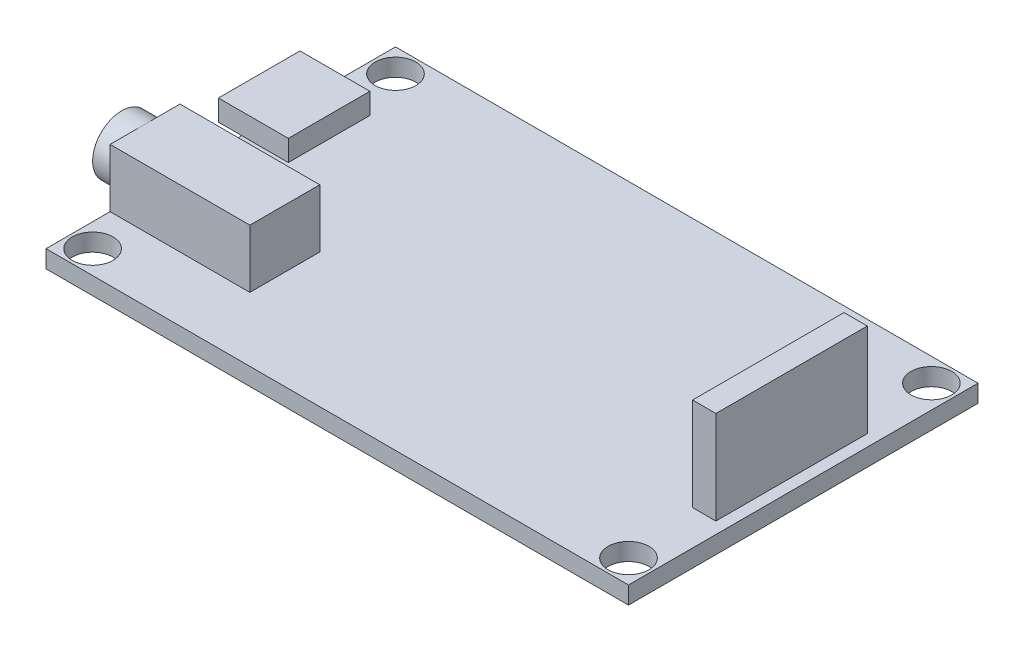
ISO-10303-21;
HEADER;
FILE_DESCRIPTION(('STEP AP214'),'2;1');
FILE_NAME('part.step','',(''),(''),'','','');
FILE_SCHEMA(('AUTOMOTIVE_DESIGN { 1 0 10303 214 1 1 1 1 }'));
ENDSEC;
DATA;
#1=APPLICATION_CONTEXT('core data for automotive mechanical design processes');
#2=APPLICATION_PROTOCOL_DEFINITION('international standard','automotive_design',2000,#1);
#3=PRODUCT_CONTEXT('',#1,'mechanical');
#4=PRODUCT('Part','Part','',(#3));
#5=PRODUCT_RELATED_PRODUCT_CATEGORY('part','',(#4));
#6=PRODUCT_DEFINITION_FORMATION('','',#4);
#7=PRODUCT_DEFINITION_CONTEXT('part definition',#1,'design');
#8=PRODUCT_DEFINITION('design','',#6,#7);
#9=PRODUCT_DEFINITION_SHAPE('','',#8);
#10=(LENGTH_UNIT() NAMED_UNIT(*) SI_UNIT(.MILLI.,.METRE.));
#11=(NAMED_UNIT(*) PLANE_ANGLE_UNIT() SI_UNIT($,.RADIAN.));
#12=(NAMED_UNIT(*) SI_UNIT($,.STERADIAN.) SOLID_ANGLE_UNIT());
#13=UNCERTAINTY_MEASURE_WITH_UNIT(LENGTH_MEASURE(1.E-05),#10,'distance_accuracy_value','');
#14=(GEOMETRIC_REPRESENTATION_CONTEXT(3) GLOBAL_UNCERTAINTY_ASSIGNED_CONTEXT((#13)) GLOBAL_UNIT_ASSIGNED_CONTEXT((#10,
#11,#12)) REPRESENTATION_CONTEXT('',''));
#15=CARTESIAN_POINT('',(0.,0.,0.));
#16=DIRECTION('',(0.,0.,1.));
#17=DIRECTION('',(1.,0.,0.));
#18=AXIS2_PLACEMENT_3D('',#15,#16,#17);
#19=CARTESIAN_POINT('',(0.,1.5,0.));
#20=DIRECTION('',(0.,1.,0.));
#21=DIRECTION('',(0.,0.,1.));
#22=AXIS2_PLACEMENT_3D('',#19,#20,#21);
#23=PLANE('',#22);
#24=CARTESIAN_POINT('',(48.,1.5,2.));
#25=DIRECTION('',(0.,1.,0.));
#26=DIRECTION('',(0.,0.,1.));
#27=AXIS2_PLACEMENT_3D('',#24,#25,#26);
#28=CIRCLE('',#27,1.75);
#29=CARTESIAN_POINT('',(48.,1.5,3.75));
#30=VERTEX_POINT('',#29);
#31=EDGE_CURVE('E269',#30,#30,#28,.T.);
#32=ORIENTED_EDGE('',*,*,#31,.F.);
#33=EDGE_LOOP('',(#32));
#34=FACE_BOUND('',#33,.T.);
#35=CARTESIAN_POINT('',(2.,1.5,2.));
#36=DIRECTION('',(0.,1.,0.));
#37=DIRECTION('',(0.,0.,1.));
#38=AXIS2_PLACEMENT_3D('',#35,#36,#37);
#39=CIRCLE('',#38,1.75);
#40=CARTESIAN_POINT('',(2.,1.5,3.75));
#41=VERTEX_POINT('',#40);
#42=EDGE_CURVE('E275',#41,#41,#39,.T.);
#43=ORIENTED_EDGE('',*,*,#42,.F.);
#44=EDGE_LOOP('',(#43));
#45=FACE_BOUND('',#44,.T.);
#46=CARTESIAN_POINT('',(2.,1.5,28.));
#47=DIRECTION('',(0.,1.,0.));
#48=DIRECTION('',(0.,0.,1.));
#49=AXIS2_PLACEMENT_3D('',#46,#47,#48);
#50=CIRCLE('',#49,1.75);
#51=CARTESIAN_POINT('',(2.,1.5,29.75));
#52=VERTEX_POINT('',#51);
#53=EDGE_CURVE('E264',#52,#52,#50,.T.);
#54=ORIENTED_EDGE('',*,*,#53,.F.);
#55=EDGE_LOOP('',(#54));
#56=FACE_BOUND('',#55,.T.);
#57=CARTESIAN_POINT('',(48.,1.5,28.));
#58=DIRECTION('',(0.,1.,0.));
#59=DIRECTION('',(0.,0.,1.));
#60=AXIS2_PLACEMENT_3D('',#57,#58,#59);
#61=CIRCLE('',#60,1.75);
#62=CARTESIAN_POINT('',(48.,1.5,29.75));
#63=VERTEX_POINT('',#62);
#64=EDGE_CURVE('E268',#63,#63,#61,.T.);
#65=ORIENTED_EDGE('',*,*,#64,.F.);
#66=EDGE_LOOP('',(#65));
#67=FACE_BOUND('',#66,.T.);
#68=DIRECTION('',(1.,0.,0.));
#69=VECTOR('',#68,1.);
#70=CARTESIAN_POINT('',(47.,1.5,21.5));
#71=LINE('',#70,#69);
#72=CARTESIAN_POINT('',(47.,1.5,21.5));
#73=VERTEX_POINT('',#72);
#74=CARTESIAN_POINT('',(49.,1.5,21.5));
#75=VERTEX_POINT('',#74);
#76=EDGE_CURVE('E249',#73,#75,#71,.T.);
#77=ORIENTED_EDGE('',*,*,#76,.F.);
#78=DIRECTION('',(0.,0.,1.));
#79=VECTOR('',#78,1.);
#80=CARTESIAN_POINT('',(47.,1.5,8.5));
#81=LINE('',#80,#79);
#82=CARTESIAN_POINT('',(47.,1.5,8.5));
#83=VERTEX_POINT('',#82);
#84=EDGE_CURVE('E235',#83,#73,#81,.T.);
#85=ORIENTED_EDGE('',*,*,#84,.F.);
#86=DIRECTION('',(-1.,0.,0.));
#87=VECTOR('',#86,1.);
#88=CARTESIAN_POINT('',(47.,1.5,8.5));
#89=LINE('',#88,#87);
#90=CARTESIAN_POINT('',(49.,1.5,8.5));
#91=VERTEX_POINT('',#90);
#92=EDGE_CURVE('E240',#91,#83,#89,.T.);
#93=ORIENTED_EDGE('',*,*,#92,.F.);
#94=DIRECTION('',(0.,0.,-1.));
#95=VECTOR('',#94,1.);
#96=CARTESIAN_POINT('',(49.,1.5,8.5));
#97=LINE('',#96,#95);
#98=EDGE_CURVE('E251',#75,#91,#97,.T.);
#99=ORIENTED_EDGE('',*,*,#98,.F.);
#100=EDGE_LOOP('',(#77,#85,#93,#99));
#101=FACE_BOUND('',#100,.T.);
#102=DIRECTION('',(0.,0.,-1.));
#103=VECTOR('',#102,1.);
#104=CARTESIAN_POINT('',(4.,1.5,13.2));
#105=LINE('',#104,#103);
#106=CARTESIAN_POINT('',(4.,1.5,13.2));
#107=VERTEX_POINT('',#106);
#108=CARTESIAN_POINT('',(4.,1.5,6.2));
#109=VERTEX_POINT('',#108);
#110=EDGE_CURVE('E62',#107,#109,#105,.T.);
#111=ORIENTED_EDGE('',*,*,#110,.F.);
#112=DIRECTION('',(1.,0.,0.));
#113=VECTOR('',#112,1.);
#114=CARTESIAN_POINT('',(-2.,1.5,13.2));
#115=LINE('',#114,#113);
#116=CARTESIAN_POINT('',(0.,1.5,13.2));
#117=VERTEX_POINT('',#116);
#118=EDGE_CURVE('E351',#117,#107,#115,.T.);
#119=ORIENTED_EDGE('',*,*,#118,.F.);
#120=DIRECTION('',(0.,0.,1.));
#121=VECTOR('',#120,1.);
#122=CARTESIAN_POINT('',(0.,1.5,0.));
#123=LINE('',#122,#121);
#124=CARTESIAN_POINT('',(0.,1.5,18.5));
#125=VERTEX_POINT('',#124);
#126=EDGE_CURVE('E293',#117,#125,#123,.T.);
#127=ORIENTED_EDGE('',*,*,#126,.T.);
#128=DIRECTION('',(-1.,0.,0.));
#129=VECTOR('',#128,1.);
#130=CARTESIAN_POINT('',(0.,1.5,18.5));
#131=LINE('',#130,#129);
#132=CARTESIAN_POINT('',(12.,1.5,18.5));
#133=VERTEX_POINT('',#132);
#134=EDGE_CURVE('E221',#133,#125,#131,.T.);
#135=ORIENTED_EDGE('',*,*,#134,.F.);
#136=DIRECTION('',(0.,0.,-1.));
#137=VECTOR('',#136,1.);
#138=CARTESIAN_POINT('',(12.,1.5,24.5));
#139=LINE('',#138,#137);
#140=CARTESIAN_POINT('',(12.,1.5,24.5));
#141=VERTEX_POINT('',#140);
#142=EDGE_CURVE('E218',#141,#133,#139,.T.);
#143=ORIENTED_EDGE('',*,*,#142,.F.);
#144=DIRECTION('',(1.,0.,0.));
#145=VECTOR('',#144,1.);
#146=CARTESIAN_POINT('',(0.,1.5,24.5));
#147=LINE('',#146,#145);
#148=CARTESIAN_POINT('',(0.,1.5,24.5));
#149=VERTEX_POINT('',#148);
#150=EDGE_CURVE('E204',#149,#141,#147,.T.);
#151=ORIENTED_EDGE('',*,*,#150,.F.);
#152=CARTESIAN_POINT('',(0.,1.5,30.));
#153=VERTEX_POINT('',#152);
#154=EDGE_CURVE('E294',#149,#153,#123,.T.);
#155=ORIENTED_EDGE('',*,*,#154,.T.);
#156=DIRECTION('',(1.,0.,0.));
#157=VECTOR('',#156,1.);
#158=CARTESIAN_POINT('',(0.,1.5,30.));
#159=LINE('',#158,#157);
#160=CARTESIAN_POINT('',(50.,1.5,30.));
#161=VERTEX_POINT('',#160);
#162=EDGE_CURVE('E291',#153,#161,#159,.T.);
#163=ORIENTED_EDGE('',*,*,#162,.T.);
#164=DIRECTION('',(0.,0.,-1.));
#165=VECTOR('',#164,1.);
#166=CARTESIAN_POINT('',(50.,1.5,0.));
#167=LINE('',#166,#165);
#168=CARTESIAN_POINT('',(50.,1.5,0.));
#169=VERTEX_POINT('',#168);
#170=EDGE_CURVE('E296',#161,#169,#167,.T.);
#171=ORIENTED_EDGE('',*,*,#170,.T.);
#172=DIRECTION('',(-1.,0.,0.));
#173=VECTOR('',#172,1.);
#174=CARTESIAN_POINT('',(0.,1.5,0.));
#175=LINE('',#174,#173);
#176=CARTESIAN_POINT('',(0.,1.5,0.));
#177=VERTEX_POINT('',#176);
#178=EDGE_CURVE('E298',#169,#177,#175,.T.);
#179=ORIENTED_EDGE('',*,*,#178,.T.);
#180=CARTESIAN_POINT('',(0.,1.5,6.2));
#181=VERTEX_POINT('',#180);
#182=EDGE_CURVE('E289',#177,#181,#123,.T.);
#183=ORIENTED_EDGE('',*,*,#182,.T.);
#184=DIRECTION('',(-1.,0.,0.));
#185=VECTOR('',#184,1.);
#186=CARTESIAN_POINT('',(-2.,1.5,6.2));
#187=LINE('',#186,#185);
#188=EDGE_CURVE('E67',#109,#181,#187,.T.);
#189=ORIENTED_EDGE('',*,*,#188,.F.);
#190=EDGE_LOOP('',(#111,#119,#127,#135,#143,#151,#155,#163,#171,#179,#183,#189));
#191=FACE_BOUND('',#190,.T.);
#192=ADVANCED_FACE('F47',(#34,#45,#56,#67,#101,#191),#23,.T.);
#193=CARTESIAN_POINT('',(0.,1.5,0.));
#194=DIRECTION('',(1.,0.,0.));
#195=DIRECTION('',(0.,0.,-1.));
#196=AXIS2_PLACEMENT_3D('',#193,#194,#195);
#197=PLANE('',#196);
#198=DIRECTION('',(0.,0.,1.));
#199=VECTOR('',#198,1.);
#200=CARTESIAN_POINT('',(0.,6.5,24.5));
#201=LINE('',#200,#199);
#202=CARTESIAN_POINT('',(0.,6.5,21.5));
#203=VERTEX_POINT('',#202);
#204=CARTESIAN_POINT('',(0.,6.5,24.5));
#205=VERTEX_POINT('',#204);
#206=EDGE_CURVE('E209',#203,#205,#201,.T.);
#207=ORIENTED_EDGE('',*,*,#206,.F.);
#208=CARTESIAN_POINT('',(0.,4.,21.5));
#209=DIRECTION('',(-1.,0.,0.));
#210=DIRECTION('',(0.,0.,1.));
#211=AXIS2_PLACEMENT_3D('',#208,#209,#210);
#212=CIRCLE('',#211,2.5);
#213=EDGE_CURVE('E194',#203,#203,#212,.T.);
#214=ORIENTED_EDGE('',*,*,#213,.F.);
#215=CARTESIAN_POINT('',(0.,6.5,18.5));
#216=VERTEX_POINT('',#215);
#217=EDGE_CURVE('E206',#216,#203,#201,.T.);
#218=ORIENTED_EDGE('',*,*,#217,.F.);
#219=DIRECTION('',(0.,-1.,0.));
#220=VECTOR('',#219,1.);
#221=CARTESIAN_POINT('',(0.,6.5,18.5));
#222=LINE('',#221,#220);
#223=EDGE_CURVE('E215',#216,#125,#222,.T.);
#224=ORIENTED_EDGE('',*,*,#223,.T.);
#225=ORIENTED_EDGE('',*,*,#126,.F.);
#226=EDGE_CURVE('E292',#181,#117,#123,.T.);
#227=ORIENTED_EDGE('',*,*,#226,.F.);
#228=ORIENTED_EDGE('',*,*,#182,.F.);
#229=DIRECTION('',(0.,-1.,0.));
#230=VECTOR('',#229,1.);
#231=CARTESIAN_POINT('',(0.,1.5,0.));
#232=LINE('',#231,#230);
#233=CARTESIAN_POINT('',(0.,0.,0.));
#234=VERTEX_POINT('',#233);
#235=EDGE_CURVE('E300',#177,#234,#232,.T.);
#236=ORIENTED_EDGE('',*,*,#235,.T.);
#237=DIRECTION('',(0.,0.,1.));
#238=VECTOR('',#237,1.);
#239=CARTESIAN_POINT('',(0.,0.,0.));
#240=LINE('',#239,#238);
#241=CARTESIAN_POINT('',(0.,0.,30.));
#242=VERTEX_POINT('',#241);
#243=EDGE_CURVE('E286',#234,#242,#240,.T.);
#244=ORIENTED_EDGE('',*,*,#243,.T.);
#245=DIRECTION('',(0.,-1.,0.));
#246=VECTOR('',#245,1.);
#247=CARTESIAN_POINT('',(0.,1.5,30.));
#248=LINE('',#247,#246);
#249=EDGE_CURVE('E13',#153,#242,#248,.T.);
#250=ORIENTED_EDGE('',*,*,#249,.F.);
#251=ORIENTED_EDGE('',*,*,#154,.F.);
#252=DIRECTION('',(0.,-1.,0.));
#253=VECTOR('',#252,1.);
#254=CARTESIAN_POINT('',(0.,6.5,24.5));
#255=LINE('',#254,#253);
#256=EDGE_CURVE('E232',#205,#149,#255,.T.);
#257=ORIENTED_EDGE('',*,*,#256,.F.);
#258=EDGE_LOOP('',(#207,#214,#218,#224,#225,#227,#228,#236,#244,#250,#251,#257));
#259=FACE_BOUND('',#258,.T.);
#260=ADVANCED_FACE('F49',(#259),#197,.F.);
#261=CARTESIAN_POINT('',(0.,1.5,30.));
#262=DIRECTION('',(0.,0.,-1.));
#263=DIRECTION('',(-1.,0.,0.));
#264=AXIS2_PLACEMENT_3D('',#261,#262,#263);
#265=PLANE('',#264);
#266=DIRECTION('',(1.,0.,0.));
#267=VECTOR('',#266,1.);
#268=CARTESIAN_POINT('',(0.,0.,30.));
#269=LINE('',#268,#267);
#270=CARTESIAN_POINT('',(50.,0.,30.));
#271=VERTEX_POINT('',#270);
#272=EDGE_CURVE('E303',#242,#271,#269,.T.);
#273=ORIENTED_EDGE('',*,*,#272,.T.);
#274=DIRECTION('',(0.,-1.,0.));
#275=VECTOR('',#274,1.);
#276=CARTESIAN_POINT('',(50.,1.5,30.));
#277=LINE('',#276,#275);
#278=EDGE_CURVE('E55',#161,#271,#277,.T.);
#279=ORIENTED_EDGE('',*,*,#278,.F.);
#280=ORIENTED_EDGE('',*,*,#162,.F.);
#281=ORIENTED_EDGE('',*,*,#249,.T.);
#282=EDGE_LOOP('',(#273,#279,#280,#281));
#283=FACE_BOUND('',#282,.T.);
#284=ADVANCED_FACE('F369',(#283),#265,.F.);
#285=CARTESIAN_POINT('',(50.,1.5,0.));
#286=DIRECTION('',(-1.,0.,0.));
#287=DIRECTION('',(0.,0.,1.));
#288=AXIS2_PLACEMENT_3D('',#285,#286,#287);
#289=PLANE('',#288);
#290=DIRECTION('',(0.,0.,-1.));
#291=VECTOR('',#290,1.);
#292=CARTESIAN_POINT('',(50.,0.,0.));
#293=LINE('',#292,#291);
#294=CARTESIAN_POINT('',(50.,0.,0.));
#295=VERTEX_POINT('',#294);
#296=EDGE_CURVE('E305',#271,#295,#293,.T.);
#297=ORIENTED_EDGE('',*,*,#296,.T.);
#298=DIRECTION('',(0.,-1.,0.));
#299=VECTOR('',#298,1.);
#300=CARTESIAN_POINT('',(50.,1.5,0.));
#301=LINE('',#300,#299);
#302=EDGE_CURVE('E311',#169,#295,#301,.T.);
#303=ORIENTED_EDGE('',*,*,#302,.F.);
#304=ORIENTED_EDGE('',*,*,#170,.F.);
#305=ORIENTED_EDGE('',*,*,#278,.T.);
#306=EDGE_LOOP('',(#297,#303,#304,#305));
#307=FACE_BOUND('',#306,.T.);
#308=ADVANCED_FACE('F318',(#307),#289,.F.);
#309=CARTESIAN_POINT('',(0.,1.5,0.));
#310=DIRECTION('',(0.,0.,1.));
#311=DIRECTION('',(1.,0.,0.));
#312=AXIS2_PLACEMENT_3D('',#309,#310,#311);
#313=PLANE('',#312);
#314=DIRECTION('',(-1.,0.,0.));
#315=VECTOR('',#314,1.);
#316=CARTESIAN_POINT('',(0.,0.,0.));
#317=LINE('',#316,#315);
#318=EDGE_CURVE('E307',#295,#234,#317,.T.);
#319=ORIENTED_EDGE('',*,*,#318,.T.);
#320=ORIENTED_EDGE('',*,*,#235,.F.);
#321=ORIENTED_EDGE('',*,*,#178,.F.);
#322=ORIENTED_EDGE('',*,*,#302,.T.);
#323=EDGE_LOOP('',(#319,#320,#321,#322));
#324=FACE_BOUND('',#323,.T.);
#325=ADVANCED_FACE('F328',(#324),#313,.F.);
#326=CARTESIAN_POINT('',(0.,0.,0.));
#327=DIRECTION('',(0.,1.,0.));
#328=DIRECTION('',(0.,0.,1.));
#329=AXIS2_PLACEMENT_3D('',#326,#327,#328);
#330=PLANE('',#329);
#331=CARTESIAN_POINT('',(48.,0.,2.));
#332=DIRECTION('',(0.,1.,0.));
#333=DIRECTION('',(0.,0.,1.));
#334=AXIS2_PLACEMENT_3D('',#331,#332,#333);
#335=CIRCLE('',#334,1.75);
#336=CARTESIAN_POINT('',(48.,0.,3.75));
#337=VERTEX_POINT('',#336);
#338=EDGE_CURVE('E265',#337,#337,#335,.T.);
#339=ORIENTED_EDGE('',*,*,#338,.T.);
#340=EDGE_LOOP('',(#339));
#341=FACE_BOUND('',#340,.T.);
#342=CARTESIAN_POINT('',(2.,0.,2.));
#343=DIRECTION('',(0.,1.,0.));
#344=DIRECTION('',(0.,0.,1.));
#345=AXIS2_PLACEMENT_3D('',#342,#343,#344);
#346=CIRCLE('',#345,1.75);
#347=CARTESIAN_POINT('',(2.,0.,3.75));
#348=VERTEX_POINT('',#347);
#349=EDGE_CURVE('E272',#348,#348,#346,.T.);
#350=ORIENTED_EDGE('',*,*,#349,.T.);
#351=EDGE_LOOP('',(#350));
#352=FACE_BOUND('',#351,.T.);
#353=CARTESIAN_POINT('',(2.,0.,28.));
#354=DIRECTION('',(0.,1.,0.));
#355=DIRECTION('',(0.,0.,1.));
#356=AXIS2_PLACEMENT_3D('',#353,#354,#355);
#357=CIRCLE('',#356,1.75);
#358=CARTESIAN_POINT('',(2.,0.,29.75));
#359=VERTEX_POINT('',#358);
#360=EDGE_CURVE('E278',#359,#359,#357,.T.);
#361=ORIENTED_EDGE('',*,*,#360,.T.);
#362=EDGE_LOOP('',(#361));
#363=FACE_BOUND('',#362,.T.);
#364=CARTESIAN_POINT('',(48.,0.,28.));
#365=DIRECTION('',(0.,1.,0.));
#366=DIRECTION('',(0.,0.,1.));
#367=AXIS2_PLACEMENT_3D('',#364,#365,#366);
#368=CIRCLE('',#367,1.75);
#369=CARTESIAN_POINT('',(48.,0.,29.75));
#370=VERTEX_POINT('',#369);
#371=EDGE_CURVE('E283',#370,#370,#368,.T.);
#372=ORIENTED_EDGE('',*,*,#371,.T.);
#373=EDGE_LOOP('',(#372));
#374=FACE_BOUND('',#373,.T.);
#375=ORIENTED_EDGE('',*,*,#243,.F.);
#376=ORIENTED_EDGE('',*,*,#318,.F.);
#377=ORIENTED_EDGE('',*,*,#296,.F.);
#378=ORIENTED_EDGE('',*,*,#272,.F.);
#379=EDGE_LOOP('',(#375,#376,#377,#378));
#380=FACE_BOUND('',#379,.T.);
#381=ADVANCED_FACE('F325',(#341,#352,#363,#374,#380),#330,.F.);
#382=CARTESIAN_POINT('',(48.,0.,28.));
#383=DIRECTION('',(0.,1.,0.));
#384=DIRECTION('',(0.,0.,1.));
#385=AXIS2_PLACEMENT_3D('',#382,#383,#384);
#386=CYLINDRICAL_SURFACE('',#385,1.75);
#387=ORIENTED_EDGE('',*,*,#371,.F.);
#388=EDGE_LOOP('',(#387));
#389=FACE_BOUND('',#388,.T.);
#390=ORIENTED_EDGE('',*,*,#64,.T.);
#391=EDGE_LOOP('',(#390));
#392=FACE_BOUND('',#391,.T.);
#393=ADVANCED_FACE('F374',(#389,#392),#386,.F.);
#394=CARTESIAN_POINT('',(2.,0.,28.));
#395=DIRECTION('',(0.,1.,0.));
#396=DIRECTION('',(0.,0.,1.));
#397=AXIS2_PLACEMENT_3D('',#394,#395,#396);
#398=CYLINDRICAL_SURFACE('',#397,1.75);
#399=ORIENTED_EDGE('',*,*,#360,.F.);
#400=EDGE_LOOP('',(#399));
#401=FACE_BOUND('',#400,.T.);
#402=ORIENTED_EDGE('',*,*,#53,.T.);
#403=EDGE_LOOP('',(#402));
#404=FACE_BOUND('',#403,.T.);
#405=ADVANCED_FACE('F449',(#401,#404),#398,.F.);
#406=CARTESIAN_POINT('',(2.,0.,2.));
#407=DIRECTION('',(0.,1.,0.));
#408=DIRECTION('',(0.,0.,1.));
#409=AXIS2_PLACEMENT_3D('',#406,#407,#408);
#410=CYLINDRICAL_SURFACE('',#409,1.75);
#411=ORIENTED_EDGE('',*,*,#349,.F.);
#412=EDGE_LOOP('',(#411));
#413=FACE_BOUND('',#412,.T.);
#414=ORIENTED_EDGE('',*,*,#42,.T.);
#415=EDGE_LOOP('',(#414));
#416=FACE_BOUND('',#415,.T.);
#417=ADVANCED_FACE('F446',(#413,#416),#410,.F.);
#418=CARTESIAN_POINT('',(48.,0.,2.));
#419=DIRECTION('',(0.,1.,0.));
#420=DIRECTION('',(0.,0.,1.));
#421=AXIS2_PLACEMENT_3D('',#418,#419,#420);
#422=CYLINDRICAL_SURFACE('',#421,1.75);
#423=ORIENTED_EDGE('',*,*,#338,.F.);
#424=EDGE_LOOP('',(#423));
#425=FACE_BOUND('',#424,.T.);
#426=ORIENTED_EDGE('',*,*,#31,.T.);
#427=EDGE_LOOP('',(#426));
#428=FACE_BOUND('',#427,.T.);
#429=ADVANCED_FACE('F442',(#425,#428),#422,.F.);
#430=CARTESIAN_POINT('',(47.,9.5,8.5));
#431=DIRECTION('',(1.,0.,0.));
#432=DIRECTION('',(0.,0.,-1.));
#433=AXIS2_PLACEMENT_3D('',#430,#431,#432);
#434=PLANE('',#433);
#435=ORIENTED_EDGE('',*,*,#84,.T.);
#436=DIRECTION('',(0.,-1.,0.));
#437=VECTOR('',#436,1.);
#438=CARTESIAN_POINT('',(47.,9.5,21.5));
#439=LINE('',#438,#437);
#440=CARTESIAN_POINT('',(47.,9.5,21.5));
#441=VERTEX_POINT('',#440);
#442=EDGE_CURVE('E262',#441,#73,#439,.T.);
#443=ORIENTED_EDGE('',*,*,#442,.F.);
#444=DIRECTION('',(0.,0.,1.));
#445=VECTOR('',#444,1.);
#446=CARTESIAN_POINT('',(47.,9.5,8.5));
#447=LINE('',#446,#445);
#448=CARTESIAN_POINT('',(47.,9.5,8.5));
#449=VERTEX_POINT('',#448);
#450=EDGE_CURVE('E236',#449,#441,#447,.T.);
#451=ORIENTED_EDGE('',*,*,#450,.F.);
#452=DIRECTION('',(0.,-1.,0.));
#453=VECTOR('',#452,1.);
#454=CARTESIAN_POINT('',(47.,9.5,8.5));
#455=LINE('',#454,#453);
#456=EDGE_CURVE('E246',#449,#83,#455,.T.);
#457=ORIENTED_EDGE('',*,*,#456,.T.);
#458=EDGE_LOOP('',(#435,#443,#451,#457));
#459=FACE_BOUND('',#458,.T.);
#460=ADVANCED_FACE('F438',(#459),#434,.F.);
#461=CARTESIAN_POINT('',(47.,9.5,21.5));
#462=DIRECTION('',(0.,0.,-1.));
#463=DIRECTION('',(-1.,0.,0.));
#464=AXIS2_PLACEMENT_3D('',#461,#462,#463);
#465=PLANE('',#464);
#466=ORIENTED_EDGE('',*,*,#76,.T.);
#467=DIRECTION('',(0.,-1.,0.));
#468=VECTOR('',#467,1.);
#469=CARTESIAN_POINT('',(49.,9.5,21.5));
#470=LINE('',#469,#468);
#471=CARTESIAN_POINT('',(49.,9.5,21.5));
#472=VERTEX_POINT('',#471);
#473=EDGE_CURVE('E259',#472,#75,#470,.T.);
#474=ORIENTED_EDGE('',*,*,#473,.F.);
#475=DIRECTION('',(1.,0.,0.));
#476=VECTOR('',#475,1.);
#477=CARTESIAN_POINT('',(47.,9.5,21.5));
#478=LINE('',#477,#476);
#479=EDGE_CURVE('E239',#441,#472,#478,.T.);
#480=ORIENTED_EDGE('',*,*,#479,.F.);
#481=ORIENTED_EDGE('',*,*,#442,.T.);
#482=EDGE_LOOP('',(#466,#474,#480,#481));
#483=FACE_BOUND('',#482,.T.);
#484=ADVANCED_FACE('F434',(#483),#465,.F.);
#485=CARTESIAN_POINT('',(49.,9.5,8.5));
#486=DIRECTION('',(-1.,0.,0.));
#487=DIRECTION('',(0.,0.,1.));
#488=AXIS2_PLACEMENT_3D('',#485,#486,#487);
#489=PLANE('',#488);
#490=ORIENTED_EDGE('',*,*,#98,.T.);
#491=DIRECTION('',(0.,-1.,0.));
#492=VECTOR('',#491,1.);
#493=CARTESIAN_POINT('',(49.,9.5,8.5));
#494=LINE('',#493,#492);
#495=CARTESIAN_POINT('',(49.,9.5,8.5));
#496=VERTEX_POINT('',#495);
#497=EDGE_CURVE('E257',#496,#91,#494,.T.);
#498=ORIENTED_EDGE('',*,*,#497,.F.);
#499=DIRECTION('',(0.,0.,-1.));
#500=VECTOR('',#499,1.);
#501=CARTESIAN_POINT('',(49.,9.5,8.5));
#502=LINE('',#501,#500);
#503=EDGE_CURVE('E242',#472,#496,#502,.T.);
#504=ORIENTED_EDGE('',*,*,#503,.F.);
#505=ORIENTED_EDGE('',*,*,#473,.T.);
#506=EDGE_LOOP('',(#490,#498,#504,#505));
#507=FACE_BOUND('',#506,.T.);
#508=ADVANCED_FACE('F430',(#507),#489,.F.);
#509=CARTESIAN_POINT('',(47.,9.5,8.5));
#510=DIRECTION('',(0.,0.,1.));
#511=DIRECTION('',(1.,0.,0.));
#512=AXIS2_PLACEMENT_3D('',#509,#510,#511);
#513=PLANE('',#512);
#514=ORIENTED_EDGE('',*,*,#92,.T.);
#515=ORIENTED_EDGE('',*,*,#456,.F.);
#516=DIRECTION('',(-1.,0.,0.));
#517=VECTOR('',#516,1.);
#518=CARTESIAN_POINT('',(47.,9.5,8.5));
#519=LINE('',#518,#517);
#520=EDGE_CURVE('E244',#496,#449,#519,.T.);
#521=ORIENTED_EDGE('',*,*,#520,.F.);
#522=ORIENTED_EDGE('',*,*,#497,.T.);
#523=EDGE_LOOP('',(#514,#515,#521,#522));
#524=FACE_BOUND('',#523,.T.);
#525=ADVANCED_FACE('F426',(#524),#513,.F.);
#526=CARTESIAN_POINT('',(0.,9.5,0.));
#527=DIRECTION('',(0.,1.,0.));
#528=DIRECTION('',(0.,0.,1.));
#529=AXIS2_PLACEMENT_3D('',#526,#527,#528);
#530=PLANE('',#529);
#531=ORIENTED_EDGE('',*,*,#450,.T.);
#532=ORIENTED_EDGE('',*,*,#479,.T.);
#533=ORIENTED_EDGE('',*,*,#503,.T.);
#534=ORIENTED_EDGE('',*,*,#520,.T.);
#535=EDGE_LOOP('',(#531,#532,#533,#534));
#536=FACE_BOUND('',#535,.T.);
#537=ADVANCED_FACE('F423',(#536),#530,.T.);
#538=CARTESIAN_POINT('',(0.,6.5,24.5));
#539=DIRECTION('',(0.,0.,-1.));
#540=DIRECTION('',(-1.,0.,0.));
#541=AXIS2_PLACEMENT_3D('',#538,#539,#540);
#542=PLANE('',#541);
#543=ORIENTED_EDGE('',*,*,#150,.T.);
#544=DIRECTION('',(0.,-1.,0.));
#545=VECTOR('',#544,1.);
#546=CARTESIAN_POINT('',(12.,6.5,24.5));
#547=LINE('',#546,#545);
#548=CARTESIAN_POINT('',(12.,6.5,24.5));
#549=VERTEX_POINT('',#548);
#550=EDGE_CURVE('E229',#549,#141,#547,.T.);
#551=ORIENTED_EDGE('',*,*,#550,.F.);
#552=DIRECTION('',(1.,0.,0.));
#553=VECTOR('',#552,1.);
#554=CARTESIAN_POINT('',(0.,6.5,24.5));
#555=LINE('',#554,#553);
#556=EDGE_CURVE('E208',#205,#549,#555,.T.);
#557=ORIENTED_EDGE('',*,*,#556,.F.);
#558=ORIENTED_EDGE('',*,*,#256,.T.);
#559=EDGE_LOOP('',(#543,#551,#557,#558));
#560=FACE_BOUND('',#559,.T.);
#561=ADVANCED_FACE('F390',(#560),#542,.F.);
#562=CARTESIAN_POINT('',(12.,6.5,24.5));
#563=DIRECTION('',(-1.,0.,0.));
#564=DIRECTION('',(0.,0.,1.));
#565=AXIS2_PLACEMENT_3D('',#562,#563,#564);
#566=PLANE('',#565);
#567=ORIENTED_EDGE('',*,*,#142,.T.);
#568=DIRECTION('',(0.,-1.,0.));
#569=VECTOR('',#568,1.);
#570=CARTESIAN_POINT('',(12.,6.5,18.5));
#571=LINE('',#570,#569);
#572=CARTESIAN_POINT('',(12.,6.5,18.5));
#573=VERTEX_POINT('',#572);
#574=EDGE_CURVE('E226',#573,#133,#571,.T.);
#575=ORIENTED_EDGE('',*,*,#574,.F.);
#576=DIRECTION('',(0.,0.,-1.));
#577=VECTOR('',#576,1.);
#578=CARTESIAN_POINT('',(12.,6.5,24.5));
#579=LINE('',#578,#577);
#580=EDGE_CURVE('E211',#549,#573,#579,.T.);
#581=ORIENTED_EDGE('',*,*,#580,.F.);
#582=ORIENTED_EDGE('',*,*,#550,.T.);
#583=EDGE_LOOP('',(#567,#575,#581,#582));
#584=FACE_BOUND('',#583,.T.);
#585=ADVANCED_FACE('F416',(#584),#566,.F.);
#586=CARTESIAN_POINT('',(0.,6.5,18.5));
#587=DIRECTION('',(0.,0.,1.));
#588=DIRECTION('',(1.,0.,0.));
#589=AXIS2_PLACEMENT_3D('',#586,#587,#588);
#590=PLANE('',#589);
#591=ORIENTED_EDGE('',*,*,#134,.T.);
#592=ORIENTED_EDGE('',*,*,#223,.F.);
#593=DIRECTION('',(-1.,0.,0.));
#594=VECTOR('',#593,1.);
#595=CARTESIAN_POINT('',(0.,6.5,18.5));
#596=LINE('',#595,#594);
#597=EDGE_CURVE('E213',#573,#216,#596,.T.);
#598=ORIENTED_EDGE('',*,*,#597,.F.);
#599=ORIENTED_EDGE('',*,*,#574,.T.);
#600=EDGE_LOOP('',(#591,#592,#598,#599));
#601=FACE_BOUND('',#600,.T.);
#602=ADVANCED_FACE('F409',(#601),#590,.F.);
#603=CARTESIAN_POINT('',(0.,6.5,0.));
#604=DIRECTION('',(0.,-1.,0.));
#605=DIRECTION('',(0.,0.,-1.));
#606=AXIS2_PLACEMENT_3D('',#603,#604,#605);
#607=PLANE('',#606);
#608=ORIENTED_EDGE('',*,*,#217,.T.);
#609=ORIENTED_EDGE('',*,*,#206,.T.);
#610=ORIENTED_EDGE('',*,*,#556,.T.);
#611=ORIENTED_EDGE('',*,*,#580,.T.);
#612=ORIENTED_EDGE('',*,*,#597,.T.);
#613=EDGE_LOOP('',(#608,#609,#610,#611,#612));
#614=FACE_BOUND('',#613,.T.);
#615=ADVANCED_FACE('F393',(#614),#607,.F.);
#616=CARTESIAN_POINT('',(-2.,4.,21.5));
#617=DIRECTION('',(1.,0.,0.));
#618=DIRECTION('',(0.,0.,-1.));
#619=AXIS2_PLACEMENT_3D('',#616,#617,#618);
#620=CYLINDRICAL_SURFACE('',#619,2.5);
#621=CARTESIAN_POINT('',(-2.,4.,21.5));
#622=DIRECTION('',(-1.,0.,0.));
#623=DIRECTION('',(0.,0.,1.));
#624=AXIS2_PLACEMENT_3D('',#621,#622,#623);
#625=CIRCLE('',#624,2.5);
#626=CARTESIAN_POINT('',(-2.,4.,24.));
#627=VERTEX_POINT('',#626);
#628=EDGE_CURVE('E197',#627,#627,#625,.T.);
#629=ORIENTED_EDGE('',*,*,#628,.F.);
#630=EDGE_LOOP('',(#629));
#631=FACE_BOUND('',#630,.T.);
#632=ORIENTED_EDGE('',*,*,#213,.T.);
#633=EDGE_LOOP('',(#632));
#634=FACE_BOUND('',#633,.T.);
#635=ADVANCED_FACE('F398',(#631,#634),#620,.T.);
#636=CARTESIAN_POINT('',(-2.,4.,21.5));
#637=DIRECTION('',(-1.,0.,0.));
#638=DIRECTION('',(0.,0.,1.));
#639=AXIS2_PLACEMENT_3D('',#636,#637,#638);
#640=PLANE('',#639);
#641=ORIENTED_EDGE('',*,*,#628,.T.);
#642=EDGE_LOOP('',(#641));
#643=FACE_BOUND('',#642,.T.);
#644=ADVANCED_FACE('F400',(#643),#640,.T.);
#645=CARTESIAN_POINT('',(0.,1.5,0.));
#646=DIRECTION('',(0.,-1.,0.));
#647=DIRECTION('',(0.,0.,-1.));
#648=AXIS2_PLACEMENT_3D('',#645,#646,#647);
#649=PLANE('',#648);
#650=ORIENTED_EDGE('',*,*,#226,.T.);
#651=CARTESIAN_POINT('',(-2.,1.5,13.2));
#652=VERTEX_POINT('',#651);
#653=EDGE_CURVE('E352',#652,#117,#115,.T.);
#654=ORIENTED_EDGE('',*,*,#653,.F.);
#655=DIRECTION('',(0.,0.,1.));
#656=VECTOR('',#655,1.);
#657=CARTESIAN_POINT('',(-2.,1.5,13.2));
#658=LINE('',#657,#656);
#659=CARTESIAN_POINT('',(-2.,1.5,6.2));
#660=VERTEX_POINT('',#659);
#661=EDGE_CURVE('E193',#660,#652,#658,.T.);
#662=ORIENTED_EDGE('',*,*,#661,.F.);
#663=EDGE_CURVE('E337',#181,#660,#187,.T.);
#664=ORIENTED_EDGE('',*,*,#663,.F.);
#665=EDGE_LOOP('',(#650,#654,#662,#664));
#666=FACE_BOUND('',#665,.T.);
#667=ADVANCED_FACE('F338',(#666),#649,.T.);
#668=CARTESIAN_POINT('',(-2.,3.3,13.2));
#669=DIRECTION('',(1.,0.,0.));
#670=DIRECTION('',(0.,0.,-1.));
#671=AXIS2_PLACEMENT_3D('',#668,#669,#670);
#672=PLANE('',#671);
#673=ORIENTED_EDGE('',*,*,#661,.T.);
#674=DIRECTION('',(0.,-1.,0.));
#675=VECTOR('',#674,1.);
#676=CARTESIAN_POINT('',(-2.,3.3,13.2));
#677=LINE('',#676,#675);
#678=CARTESIAN_POINT('',(-2.,3.3,13.2));
#679=VERTEX_POINT('',#678);
#680=EDGE_CURVE('E174',#679,#652,#677,.T.);
#681=ORIENTED_EDGE('',*,*,#680,.F.);
#682=DIRECTION('',(0.,0.,1.));
#683=VECTOR('',#682,1.);
#684=CARTESIAN_POINT('',(-2.,3.3,13.2));
#685=LINE('',#684,#683);
#686=CARTESIAN_POINT('',(-2.,3.3,6.2));
#687=VERTEX_POINT('',#686);
#688=EDGE_CURVE('E181',#687,#679,#685,.T.);
#689=ORIENTED_EDGE('',*,*,#688,.F.);
#690=DIRECTION('',(0.,-1.,0.));
#691=VECTOR('',#690,1.);
#692=CARTESIAN_POINT('',(-2.,3.3,6.2));
#693=LINE('',#692,#691);
#694=EDGE_CURVE('E347',#687,#660,#693,.T.);
#695=ORIENTED_EDGE('',*,*,#694,.T.);
#696=EDGE_LOOP('',(#673,#681,#689,#695));
#697=FACE_BOUND('',#696,.T.);
#698=ADVANCED_FACE('F191',(#697),#672,.F.);
#699=CARTESIAN_POINT('',(-2.,3.3,13.2));
#700=DIRECTION('',(0.,0.,-1.));
#701=DIRECTION('',(-1.,0.,0.));
#702=AXIS2_PLACEMENT_3D('',#699,#700,#701);
#703=PLANE('',#702);
#704=ORIENTED_EDGE('',*,*,#653,.T.);
#705=ORIENTED_EDGE('',*,*,#118,.T.);
#706=DIRECTION('',(0.,-1.,0.));
#707=VECTOR('',#706,1.);
#708=CARTESIAN_POINT('',(4.,3.3,13.2));
#709=LINE('',#708,#707);
#710=CARTESIAN_POINT('',(4.,3.3,13.2));
#711=VERTEX_POINT('',#710);
#712=EDGE_CURVE('E177',#711,#107,#709,.T.);
#713=ORIENTED_EDGE('',*,*,#712,.F.);
#714=DIRECTION('',(1.,0.,0.));
#715=VECTOR('',#714,1.);
#716=CARTESIAN_POINT('',(-2.,3.3,13.2));
#717=LINE('',#716,#715);
#718=EDGE_CURVE('E169',#679,#711,#717,.T.);
#719=ORIENTED_EDGE('',*,*,#718,.F.);
#720=ORIENTED_EDGE('',*,*,#680,.T.);
#721=EDGE_LOOP('',(#704,#705,#713,#719,#720));
#722=FACE_BOUND('',#721,.T.);
#723=ADVANCED_FACE('F172',(#722),#703,.F.);
#724=CARTESIAN_POINT('',(4.,3.3,13.2));
#725=DIRECTION('',(-1.,0.,0.));
#726=DIRECTION('',(0.,0.,1.));
#727=AXIS2_PLACEMENT_3D('',#724,#725,#726);
#728=PLANE('',#727);
#729=ORIENTED_EDGE('',*,*,#110,.T.);
#730=DIRECTION('',(0.,-1.,0.));
#731=VECTOR('',#730,1.);
#732=CARTESIAN_POINT('',(4.,3.3,6.2));
#733=LINE('',#732,#731);
#734=CARTESIAN_POINT('',(4.,3.3,6.2));
#735=VERTEX_POINT('',#734);
#736=EDGE_CURVE('E199',#735,#109,#733,.T.);
#737=ORIENTED_EDGE('',*,*,#736,.F.);
#738=DIRECTION('',(0.,0.,-1.));
#739=VECTOR('',#738,1.);
#740=CARTESIAN_POINT('',(4.,3.3,13.2));
#741=LINE('',#740,#739);
#742=EDGE_CURVE('E180',#711,#735,#741,.T.);
#743=ORIENTED_EDGE('',*,*,#742,.F.);
#744=ORIENTED_EDGE('',*,*,#712,.T.);
#745=EDGE_LOOP('',(#729,#737,#743,#744));
#746=FACE_BOUND('',#745,.T.);
#747=ADVANCED_FACE('F354',(#746),#728,.F.);
#748=CARTESIAN_POINT('',(-2.,3.3,6.2));
#749=DIRECTION('',(0.,0.,1.));
#750=DIRECTION('',(1.,0.,0.));
#751=AXIS2_PLACEMENT_3D('',#748,#749,#750);
#752=PLANE('',#751);
#753=ORIENTED_EDGE('',*,*,#188,.T.);
#754=ORIENTED_EDGE('',*,*,#663,.T.);
#755=ORIENTED_EDGE('',*,*,#694,.F.);
#756=DIRECTION('',(-1.,0.,0.));
#757=VECTOR('',#756,1.);
#758=CARTESIAN_POINT('',(-2.,3.3,6.2));
#759=LINE('',#758,#757);
#760=EDGE_CURVE('E186',#735,#687,#759,.T.);
#761=ORIENTED_EDGE('',*,*,#760,.F.);
#762=ORIENTED_EDGE('',*,*,#736,.T.);
#763=EDGE_LOOP('',(#753,#754,#755,#761,#762));
#764=FACE_BOUND('',#763,.T.);
#765=ADVANCED_FACE('F342',(#764),#752,.F.);
#766=CARTESIAN_POINT('',(0.,3.3,0.));
#767=DIRECTION('',(0.,-1.,0.));
#768=DIRECTION('',(0.,0.,-1.));
#769=AXIS2_PLACEMENT_3D('',#766,#767,#768);
#770=PLANE('',#769);
#771=ORIENTED_EDGE('',*,*,#688,.T.);
#772=ORIENTED_EDGE('',*,*,#718,.T.);
#773=ORIENTED_EDGE('',*,*,#742,.T.);
#774=ORIENTED_EDGE('',*,*,#760,.T.);
#775=EDGE_LOOP('',(#771,#772,#773,#774));
#776=FACE_BOUND('',#775,.T.);
#777=ADVANCED_FACE('F184',(#776),#770,.F.);
#778=CLOSED_SHELL('',(#192,#260,#284,#308,#325,#381,#393,#405,#417,#429,#460,#484,#508,#525,
#537,#561,#585,#602,#615,#635,#644,#667,#698,#723,#747,#765,#777));
#779=MANIFOLD_SOLID_BREP('B2',#778);
#780=ADVANCED_BREP_SHAPE_REPRESENTATION('',(#18,#779),#14);
#781=SHAPE_DEFINITION_REPRESENTATION(#9,#780);
ENDSEC;
END-ISO-10303-21;
